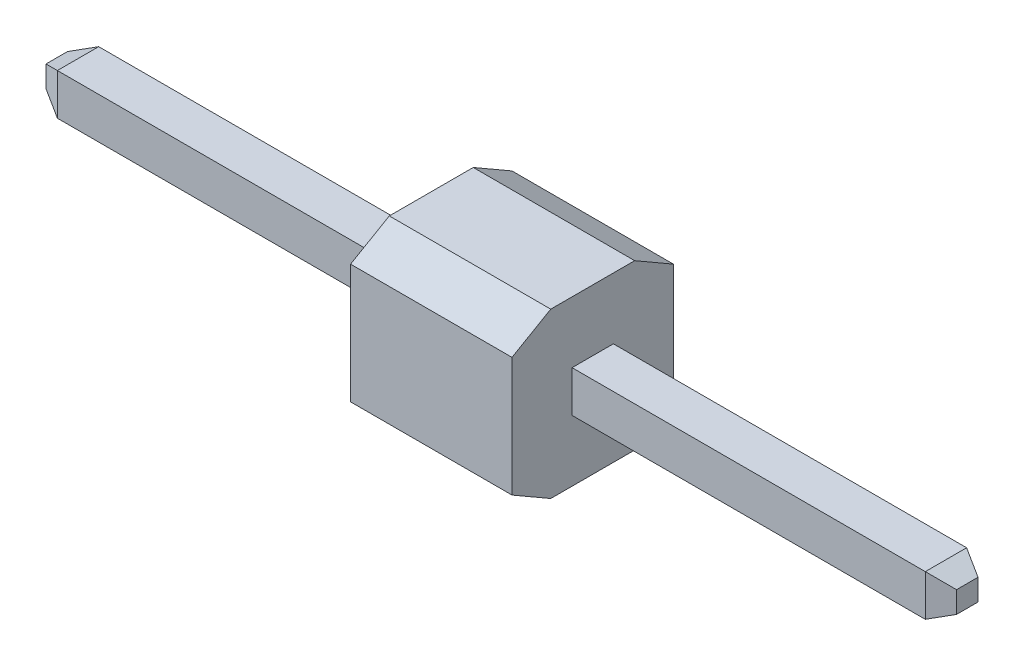
ISO-10303-21;
HEADER;
FILE_DESCRIPTION(('STEP AP214'),'2;1');
FILE_NAME('part.step','',(''),(''),'','','');
FILE_SCHEMA(('AUTOMOTIVE_DESIGN { 1 0 10303 214 1 1 1 1 }'));
ENDSEC;
DATA;
#1=APPLICATION_CONTEXT('core data for automotive mechanical design processes');
#2=APPLICATION_PROTOCOL_DEFINITION('international standard','automotive_design',2000,#1);
#3=PRODUCT_CONTEXT('',#1,'mechanical');
#4=PRODUCT('Part','Part','',(#3));
#5=PRODUCT_RELATED_PRODUCT_CATEGORY('part','',(#4));
#6=PRODUCT_DEFINITION_FORMATION('','',#4);
#7=PRODUCT_DEFINITION_CONTEXT('part definition',#1,'design');
#8=PRODUCT_DEFINITION('design','',#6,#7);
#9=PRODUCT_DEFINITION_SHAPE('','',#8);
#10=(LENGTH_UNIT() NAMED_UNIT(*) SI_UNIT(.MILLI.,.METRE.));
#11=(NAMED_UNIT(*) PLANE_ANGLE_UNIT() SI_UNIT($,.RADIAN.));
#12=(NAMED_UNIT(*) SI_UNIT($,.STERADIAN.) SOLID_ANGLE_UNIT());
#13=UNCERTAINTY_MEASURE_WITH_UNIT(LENGTH_MEASURE(1.E-05),#10,'distance_accuracy_value','');
#14=(GEOMETRIC_REPRESENTATION_CONTEXT(3) GLOBAL_UNCERTAINTY_ASSIGNED_CONTEXT((#13)) GLOBAL_UNIT_ASSIGNED_CONTEXT((#10,
#11,#12)) REPRESENTATION_CONTEXT('',''));
#15=CARTESIAN_POINT('',(0.,0.,0.));
#16=DIRECTION('',(0.,0.,1.));
#17=DIRECTION('',(1.,0.,0.));
#18=AXIS2_PLACEMENT_3D('',#15,#16,#17);
#19=CARTESIAN_POINT('',(5.42110019531582,-2.22288427394286,-2.77112037351091));
#20=DIRECTION('',(1.,-9.93476518829084E-08,4.37113882867379E-08));
#21=DIRECTION('',(-9.93476589883358E-08,-1.,8.74227765734759E-08));
#22=AXIS2_PLACEMENT_3D('',#19,#20,#21);
#23=PLANE('',#22);
#24=DIRECTION('',(-1.18186619959243E-08,-0.50000007571054,-0.866025360072933));
#25=VECTOR('',#24,1.);
#26=CARTESIAN_POINT('',(5.42110000314121,-3.46647397517509,-1.20112026479284));
#27=LINE('',#26,#25);
#28=CARTESIAN_POINT('',(5.42110000314121,-3.46647397517509,-1.20112026479284));
#29=VERTEX_POINT('',#28);
#30=CARTESIAN_POINT('',(5.421099994953,-3.81288418914276,-1.8011202345087));
#31=VERTEX_POINT('',#30);
#32=EDGE_CURVE('E11',#29,#31,#27,.T.);
#33=ORIENTED_EDGE('',*,*,#32,.T.);
#34=DIRECTION('',(4.37113811813104E-08,-8.74227828590458E-08,-0.999999999999995));
#35=VECTOR('',#34,1.);
#36=CARTESIAN_POINT('',(5.421099994953,-3.81288418914276,-1.8011202345087));
#37=LINE('',#36,#35);
#38=CARTESIAN_POINT('',(5.4211000517778,-3.81288430279238,-3.1011202345087));
#39=VERTEX_POINT('',#38);
#40=EDGE_CURVE('E304',#31,#39,#37,.T.);
#41=ORIENTED_EDGE('',*,*,#40,.T.);
#42=DIRECTION('',(8.75289950709518E-08,0.499999924289835,-0.866025447495714));
#43=VECTOR('',#42,1.);
#44=CARTESIAN_POINT('',(5.4211000517778,-3.81288430279238,-3.1011202345087));
#45=LINE('',#44,#43);
#46=CARTESIAN_POINT('',(5.42110011241966,-3.46647419373205,-3.70112026479284));
#47=VERTEX_POINT('',#46);
#48=EDGE_CURVE('E296',#39,#47,#45,.T.);
#49=ORIENTED_EDGE('',*,*,#48,.T.);
#50=DIRECTION('',(9.93476593246923E-08,0.999999999999991,-8.7422776482468E-08));
#51=VECTOR('',#50,1.);
#52=CARTESIAN_POINT('',(5.42110011241966,-3.46647419373205,-3.70112026479284));
#53=LINE('',#52,#51);
#54=CARTESIAN_POINT('',(5.42110029593264,-1.61929451676605,-3.70112042627841));
#55=VERTEX_POINT('',#54);
#56=EDGE_CURVE('E281',#47,#55,#53,.T.);
#57=ORIENTED_EDGE('',*,*,#56,.T.);
#58=DIRECTION('',(-1.18186619958731E-08,-0.500000075710537,-0.866025360072935));
#59=VECTOR('',#58,1.);
#60=CARTESIAN_POINT('',(5.42110030412085,-1.27288430279238,-3.10112045656255));
#61=LINE('',#60,#59);
#62=CARTESIAN_POINT('',(5.42110030412085,-1.27288430279238,-3.10112045656255));
#63=VERTEX_POINT('',#62);
#64=EDGE_CURVE('E265',#63,#55,#61,.T.);
#65=ORIENTED_EDGE('',*,*,#64,.F.);
#66=DIRECTION('',(4.37113811813104E-08,-8.74227828590458E-08,-0.999999999999995));
#67=VECTOR('',#66,1.);
#68=CARTESIAN_POINT('',(5.42110024729606,-1.27288418914276,-1.80112045656255));
#69=LINE('',#68,#67);
#70=CARTESIAN_POINT('',(5.42110024729606,-1.27288418914276,-1.80112045656255));
#71=VERTEX_POINT('',#70);
#72=EDGE_CURVE('E248',#71,#63,#69,.T.);
#73=ORIENTED_EDGE('',*,*,#72,.F.);
#74=DIRECTION('',(8.75289950705729E-08,0.499999924289834,-0.866025447495714));
#75=VECTOR('',#74,1.);
#76=CARTESIAN_POINT('',(5.42110018665419,-1.61929429820909,-1.20112042627841));
#77=LINE('',#76,#75);
#78=CARTESIAN_POINT('',(5.42110018665419,-1.61929429820909,-1.20112042627841));
#79=VERTEX_POINT('',#78);
#80=EDGE_CURVE('E242',#79,#71,#77,.T.);
#81=ORIENTED_EDGE('',*,*,#80,.F.);
#82=DIRECTION('',(9.93476593246923E-08,0.999999999999991,-8.7422776482468E-08));
#83=VECTOR('',#82,1.);
#84=CARTESIAN_POINT('',(5.42110000314121,-3.46647397517509,-1.20112026479284));
#85=LINE('',#84,#83);
#86=EDGE_CURVE('E236',#29,#79,#85,.T.);
#87=ORIENTED_EDGE('',*,*,#86,.F.);
#88=EDGE_LOOP('',(#33,#41,#49,#57,#65,#73,#81,#87));
#89=FACE_BOUND('',#88,.T.);
#90=DIRECTION('',(-4.37113803486431E-08,8.74227829017466E-08,0.999999999999995));
#91=VECTOR('',#90,1.);
#92=CARTESIAN_POINT('',(5.42110013173332,-2.86288427394286,-2.77112031756034));
#93=LINE('',#92,#91);
#94=CARTESIAN_POINT('',(5.42110013173332,-2.86288427394286,-2.77112031756034));
#95=VERTEX_POINT('',#94);
#96=CARTESIAN_POINT('',(5.42110010375803,-2.86288421799228,-2.13112031756034));
#97=VERTEX_POINT('',#96);
#98=EDGE_CURVE('E302',#95,#97,#93,.T.);
#99=ORIENTED_EDGE('',*,*,#98,.T.);
#100=DIRECTION('',(-9.93476592658906E-08,-0.999999999999991,8.74227766567418E-08));
#101=VECTOR('',#100,1.);
#102=CARTESIAN_POINT('',(5.42110016734054,-2.22288421799228,-2.13112037351091));
#103=LINE('',#102,#101);
#104=CARTESIAN_POINT('',(5.42110016734054,-2.22288421799228,-2.13112037351091));
#105=VERTEX_POINT('',#104);
#106=EDGE_CURVE('E293',#105,#97,#103,.T.);
#107=ORIENTED_EDGE('',*,*,#106,.F.);
#108=DIRECTION('',(-4.37113803486431E-08,8.74227829017466E-08,0.999999999999995));
#109=VECTOR('',#108,1.);
#110=CARTESIAN_POINT('',(5.42110019531582,-2.22288427394286,-2.77112037351091));
#111=LINE('',#110,#109);
#112=CARTESIAN_POINT('',(5.42110019531582,-2.22288427394286,-2.77112037351091));
#113=VERTEX_POINT('',#112);
#114=EDGE_CURVE('E278',#113,#105,#111,.T.);
#115=ORIENTED_EDGE('',*,*,#114,.F.);
#116=DIRECTION('',(-9.93476592658906E-08,-0.999999999999991,8.74227766567418E-08));
#117=VECTOR('',#116,1.);
#118=CARTESIAN_POINT('',(5.42110019531582,-2.22288427394286,-2.77112037351091));
#119=LINE('',#118,#117);
#120=EDGE_CURVE('E263',#113,#95,#119,.T.);
#121=ORIENTED_EDGE('',*,*,#120,.T.);
#122=EDGE_LOOP('',(#99,#107,#115,#121));
#123=FACE_BOUND('',#122,.T.);
#124=ADVANCED_FACE('F17',(#89,#123),#23,.T.);
#125=CARTESIAN_POINT('',(2.92110019531582,-2.22288402557373,-2.77112048278938));
#126=DIRECTION('',(1.,-9.93476518829084E-08,4.37113882867379E-08));
#127=DIRECTION('',(-9.93476589883358E-08,-1.,8.74227765734759E-08));
#128=AXIS2_PLACEMENT_3D('',#125,#126,#127);
#129=PLANE('',#128);
#130=DIRECTION('',(-1.18186632778994E-08,-0.50000007571054,-0.866025360072933));
#131=VECTOR('',#130,1.);
#132=CARTESIAN_POINT('',(2.92110000314121,-3.46647372680596,-1.20112037407131));
#133=LINE('',#132,#131);
#134=CARTESIAN_POINT('',(2.92110000314121,-3.46647372680596,-1.20112037407131));
#135=VERTEX_POINT('',#134);
#136=CARTESIAN_POINT('',(2.921099994953,-3.81288394077363,-1.80112034378717));
#137=VERTEX_POINT('',#136);
#138=EDGE_CURVE('E24',#135,#137,#133,.T.);
#139=ORIENTED_EDGE('',*,*,#138,.F.);
#140=DIRECTION('',(9.93476588438628E-08,0.999999999999991,-8.7422776482468E-08));
#141=VECTOR('',#140,1.);
#142=CARTESIAN_POINT('',(2.92110000314121,-3.46647372680596,-1.20112037407131));
#143=LINE('',#142,#141);
#144=CARTESIAN_POINT('',(2.92110018665419,-1.61929404983996,-1.20112053555688));
#145=VERTEX_POINT('',#144);
#146=EDGE_CURVE('E300',#135,#145,#143,.T.);
#147=ORIENTED_EDGE('',*,*,#146,.T.);
#148=DIRECTION('',(8.7528996352548E-08,0.499999924289834,-0.866025447495714));
#149=VECTOR('',#148,1.);
#150=CARTESIAN_POINT('',(2.92110018665419,-1.61929404983996,-1.20112053555688));
#151=LINE('',#150,#149);
#152=CARTESIAN_POINT('',(2.92110024729606,-1.27288394077363,-1.80112056584102));
#153=VERTEX_POINT('',#152);
#154=EDGE_CURVE('E286',#145,#153,#151,.T.);
#155=ORIENTED_EDGE('',*,*,#154,.T.);
#156=DIRECTION('',(4.37113811813104E-08,-8.74227828590458E-08,-0.999999999999995));
#157=VECTOR('',#156,1.);
#158=CARTESIAN_POINT('',(2.92110024729606,-1.27288394077363,-1.80112056584102));
#159=LINE('',#158,#157);
#160=CARTESIAN_POINT('',(2.92110030412085,-1.27288405442325,-3.10112056584102));
#161=VERTEX_POINT('',#160);
#162=EDGE_CURVE('E271',#153,#161,#159,.T.);
#163=ORIENTED_EDGE('',*,*,#162,.T.);
#164=DIRECTION('',(-1.18186632778483E-08,-0.500000075710537,-0.866025360072935));
#165=VECTOR('',#164,1.);
#166=CARTESIAN_POINT('',(2.92110030412085,-1.27288405442325,-3.10112056584102));
#167=LINE('',#166,#165);
#168=CARTESIAN_POINT('',(2.92110029593264,-1.61929426839692,-3.70112053555688));
#169=VERTEX_POINT('',#168);
#170=EDGE_CURVE('E253',#161,#169,#167,.T.);
#171=ORIENTED_EDGE('',*,*,#170,.T.);
#172=DIRECTION('',(9.93476588438628E-08,0.999999999999991,-8.7422776482468E-08));
#173=VECTOR('',#172,1.);
#174=CARTESIAN_POINT('',(2.92110011241966,-3.46647394536292,-3.70112037407131));
#175=LINE('',#174,#173);
#176=CARTESIAN_POINT('',(2.92110011241966,-3.46647394536292,-3.70112037407131));
#177=VERTEX_POINT('',#176);
#178=EDGE_CURVE('E261',#177,#169,#175,.T.);
#179=ORIENTED_EDGE('',*,*,#178,.F.);
#180=DIRECTION('',(8.75289963529269E-08,0.499999924289835,-0.866025447495714));
#181=VECTOR('',#180,1.);
#182=CARTESIAN_POINT('',(2.9211000517778,-3.81288405442325,-3.10112034378717));
#183=LINE('',#182,#181);
#184=CARTESIAN_POINT('',(2.9211000517778,-3.81288405442325,-3.10112034378717));
#185=VERTEX_POINT('',#184);
#186=EDGE_CURVE('E276',#185,#177,#183,.T.);
#187=ORIENTED_EDGE('',*,*,#186,.F.);
#188=DIRECTION('',(4.37113811813104E-08,-8.74227828590458E-08,-0.999999999999995));
#189=VECTOR('',#188,1.);
#190=CARTESIAN_POINT('',(2.921099994953,-3.81288394077363,-1.80112034378717));
#191=LINE('',#190,#189);
#192=EDGE_CURVE('E291',#137,#185,#191,.T.);
#193=ORIENTED_EDGE('',*,*,#192,.F.);
#194=EDGE_LOOP('',(#139,#147,#155,#163,#171,#179,#187,#193));
#195=FACE_BOUND('',#194,.T.);
#196=DIRECTION('',(-9.93476585720012E-08,-0.999999999999991,8.74227766567418E-08));
#197=VECTOR('',#196,1.);
#198=CARTESIAN_POINT('',(2.92110016734053,-2.22288396962315,-2.13112048278938));
#199=LINE('',#198,#197);
#200=CARTESIAN_POINT('',(2.92110016734053,-2.22288396962315,-2.13112048278938));
#201=VERTEX_POINT('',#200);
#202=CARTESIAN_POINT('',(2.92110010375803,-2.86288396962315,-2.13112042683881));
#203=VERTEX_POINT('',#202);
#204=EDGE_CURVE('E298',#201,#203,#199,.T.);
#205=ORIENTED_EDGE('',*,*,#204,.T.);
#206=DIRECTION('',(-4.37113810425325E-08,8.74227829017466E-08,0.999999999999995));
#207=VECTOR('',#206,1.);
#208=CARTESIAN_POINT('',(2.92110013173332,-2.86288402557373,-2.77112042683881));
#209=LINE('',#208,#207);
#210=CARTESIAN_POINT('',(2.92110013173332,-2.86288402557373,-2.77112042683881));
#211=VERTEX_POINT('',#210);
#212=EDGE_CURVE('E283',#211,#203,#209,.T.);
#213=ORIENTED_EDGE('',*,*,#212,.F.);
#214=DIRECTION('',(-9.93476585720012E-08,-0.999999999999991,8.74227766567418E-08));
#215=VECTOR('',#214,1.);
#216=CARTESIAN_POINT('',(2.92110019531582,-2.22288402557373,-2.77112048278938));
#217=LINE('',#216,#215);
#218=CARTESIAN_POINT('',(2.92110019531582,-2.22288402557373,-2.77112048278938));
#219=VERTEX_POINT('',#218);
#220=EDGE_CURVE('E268',#219,#211,#217,.T.);
#221=ORIENTED_EDGE('',*,*,#220,.F.);
#222=DIRECTION('',(-4.37113810425325E-08,8.74227829017466E-08,0.999999999999995));
#223=VECTOR('',#222,1.);
#224=CARTESIAN_POINT('',(2.92110019531582,-2.22288402557373,-2.77112048278938));
#225=LINE('',#224,#223);
#226=EDGE_CURVE('E251',#219,#201,#225,.T.);
#227=ORIENTED_EDGE('',*,*,#226,.T.);
#228=EDGE_LOOP('',(#205,#213,#221,#227));
#229=FACE_BOUND('',#228,.T.);
#230=ADVANCED_FACE('F314',(#195,#229),#129,.F.);
#231=CARTESIAN_POINT('',(5.42110000314121,-3.46647397517509,-1.20112026479284));
#232=DIRECTION('',(1.07893287081065E-07,0.866025360072937,-0.500000075710535));
#233=DIRECTION('',(1.18186629566715E-08,0.500000075710542,0.866025360072941));
#234=AXIS2_PLACEMENT_3D('',#231,#232,#233);
#235=PLANE('',#234);
#236=ORIENTED_EDGE('',*,*,#138,.T.);
#237=DIRECTION('',(-0.999999999999994,9.93476518829078E-08,-4.37113883755555E-08));
#238=VECTOR('',#237,1.);
#239=CARTESIAN_POINT('',(5.421099994953,-3.81288418914276,-1.8011202345087));
#240=LINE('',#239,#238);
#241=EDGE_CURVE('E288',#31,#137,#240,.T.);
#242=ORIENTED_EDGE('',*,*,#241,.F.);
#243=ORIENTED_EDGE('',*,*,#32,.F.);
#244=DIRECTION('',(-0.999999999999994,9.93476525934506E-08,-4.3711388109102E-08));
#245=VECTOR('',#244,1.);
#246=CARTESIAN_POINT('',(5.42110000314121,-3.46647397517509,-1.20112026479284));
#247=LINE('',#246,#245);
#248=EDGE_CURVE('E256',#29,#135,#247,.T.);
#249=ORIENTED_EDGE('',*,*,#248,.T.);
#250=EDGE_LOOP('',(#236,#242,#243,#249));
#251=FACE_BOUND('',#250,.T.);
#252=ADVANCED_FACE('F306',(#251),#235,.F.);
#253=CARTESIAN_POINT('',(5.421099994953,-3.81288418914276,-1.8011202345087));
#254=DIRECTION('',(9.93476589883358E-08,1.,-8.74227765734759E-08));
#255=DIRECTION('',(1.,-9.93476518829084E-08,4.37113882867379E-08));
#256=AXIS2_PLACEMENT_3D('',#253,#254,#255);
#257=PLANE('',#256);
#258=ORIENTED_EDGE('',*,*,#192,.T.);
#259=DIRECTION('',(-0.999999999999994,9.93476518829078E-08,-4.37113884643734E-08));
#260=VECTOR('',#259,1.);
#261=CARTESIAN_POINT('',(5.4211000517778,-3.81288430279238,-3.1011202345087));
#262=LINE('',#261,#260);
#263=EDGE_CURVE('E273',#39,#185,#262,.T.);
#264=ORIENTED_EDGE('',*,*,#263,.F.);
#265=ORIENTED_EDGE('',*,*,#40,.F.);
#266=ORIENTED_EDGE('',*,*,#241,.T.);
#267=EDGE_LOOP('',(#258,#264,#265,#266));
#268=FACE_BOUND('',#267,.T.);
#269=ADVANCED_FACE('F311',(#268),#257,.F.);
#270=CARTESIAN_POINT('',(5.4211000517778,-3.81288430279238,-3.1011202345087));
#271=DIRECTION('',(6.41819058997377E-08,0.866025447495721,0.499999924289845));
#272=DIRECTION('',(-8.7528996031702E-08,-0.499999924289838,0.866025447495717));
#273=AXIS2_PLACEMENT_3D('',#270,#271,#272);
#274=PLANE('',#273);
#275=ORIENTED_EDGE('',*,*,#186,.T.);
#276=DIRECTION('',(-0.999999999999994,9.93476525934506E-08,-4.37113882867377E-08));
#277=VECTOR('',#276,1.);
#278=CARTESIAN_POINT('',(5.42110011241966,-3.46647419373205,-3.70112026479284));
#279=LINE('',#278,#277);
#280=EDGE_CURVE('E258',#47,#177,#279,.T.);
#281=ORIENTED_EDGE('',*,*,#280,.F.);
#282=ORIENTED_EDGE('',*,*,#48,.F.);
#283=ORIENTED_EDGE('',*,*,#263,.T.);
#284=EDGE_LOOP('',(#275,#281,#282,#283));
#285=FACE_BOUND('',#284,.T.);
#286=ADVANCED_FACE('F319',(#285),#274,.F.);
#287=CARTESIAN_POINT('',(5.42110011241966,-3.46647419373205,-3.70112026479284));
#288=DIRECTION('',(-4.37113811813106E-08,8.74227836789032E-08,1.));
#289=DIRECTION('',(-1.,9.93476518829084E-08,-4.37113882867379E-08));
#290=AXIS2_PLACEMENT_3D('',#287,#288,#289);
#291=PLANE('',#290);
#292=ORIENTED_EDGE('',*,*,#178,.T.);
#293=DIRECTION('',(-0.999999999999994,9.93476525934505E-08,-4.37113884643734E-08));
#294=VECTOR('',#293,1.);
#295=CARTESIAN_POINT('',(5.42110029593264,-1.61929451676605,-3.70112042627841));
#296=LINE('',#295,#294);
#297=EDGE_CURVE('E245',#55,#169,#296,.T.);
#298=ORIENTED_EDGE('',*,*,#297,.F.);
#299=ORIENTED_EDGE('',*,*,#56,.F.);
#300=ORIENTED_EDGE('',*,*,#280,.T.);
#301=EDGE_LOOP('',(#292,#298,#299,#300));
#302=FACE_BOUND('',#301,.T.);
#303=ADVANCED_FACE('F326',(#302),#291,.F.);
#304=CARTESIAN_POINT('',(5.42110030412085,-1.27288430279238,-3.10112045656255));
#305=DIRECTION('',(1.07893287081065E-07,0.866025360072937,-0.500000075710535));
#306=DIRECTION('',(1.18186629566715E-08,0.500000075710542,0.866025360072941));
#307=AXIS2_PLACEMENT_3D('',#304,#305,#306);
#308=PLANE('',#307);
#309=ORIENTED_EDGE('',*,*,#170,.F.);
#310=DIRECTION('',(-0.999999999999994,9.93476518829078E-08,-4.37113882867377E-08));
#311=VECTOR('',#310,1.);
#312=CARTESIAN_POINT('',(5.42110030412085,-1.27288430279238,-3.10112045656255));
#313=LINE('',#312,#311);
#314=EDGE_CURVE('E239',#63,#161,#313,.T.);
#315=ORIENTED_EDGE('',*,*,#314,.F.);
#316=ORIENTED_EDGE('',*,*,#64,.T.);
#317=ORIENTED_EDGE('',*,*,#297,.T.);
#318=EDGE_LOOP('',(#309,#315,#316,#317));
#319=FACE_BOUND('',#318,.T.);
#320=ADVANCED_FACE('F329',(#319),#308,.T.);
#321=CARTESIAN_POINT('',(5.42110024729606,-1.27288418914276,-1.80112045656255));
#322=DIRECTION('',(9.93476589883358E-08,1.,-8.74227765734759E-08));
#323=DIRECTION('',(1.,-9.93476518829084E-08,4.37113882867379E-08));
#324=AXIS2_PLACEMENT_3D('',#321,#322,#323);
#325=PLANE('',#324);
#326=ORIENTED_EDGE('',*,*,#162,.F.);
#327=DIRECTION('',(-0.999999999999994,9.93476518829078E-08,-4.37113883755555E-08));
#328=VECTOR('',#327,1.);
#329=CARTESIAN_POINT('',(5.42110024729606,-1.27288418914276,-1.80112045656255));
#330=LINE('',#329,#328);
#331=EDGE_CURVE('E233',#71,#153,#330,.T.);
#332=ORIENTED_EDGE('',*,*,#331,.F.);
#333=ORIENTED_EDGE('',*,*,#72,.T.);
#334=ORIENTED_EDGE('',*,*,#314,.T.);
#335=EDGE_LOOP('',(#326,#332,#333,#334));
#336=FACE_BOUND('',#335,.T.);
#337=ADVANCED_FACE('F333',(#336),#325,.T.);
#338=CARTESIAN_POINT('',(5.42110018665419,-1.61929429820909,-1.20112042627841));
#339=DIRECTION('',(6.41819058997377E-08,0.866025447495721,0.499999924289845));
#340=DIRECTION('',(-8.7528996031702E-08,-0.499999924289838,0.866025447495717));
#341=AXIS2_PLACEMENT_3D('',#338,#339,#340);
#342=PLANE('',#341);
#343=ORIENTED_EDGE('',*,*,#154,.F.);
#344=DIRECTION('',(-0.999999999999994,9.93476525934505E-08,-4.3711388109102E-08));
#345=VECTOR('',#344,1.);
#346=CARTESIAN_POINT('',(5.42110018665419,-1.61929429820909,-1.20112042627841));
#347=LINE('',#346,#345);
#348=EDGE_CURVE('E230',#79,#145,#347,.T.);
#349=ORIENTED_EDGE('',*,*,#348,.F.);
#350=ORIENTED_EDGE('',*,*,#80,.T.);
#351=ORIENTED_EDGE('',*,*,#331,.T.);
#352=EDGE_LOOP('',(#343,#349,#350,#351));
#353=FACE_BOUND('',#352,.T.);
#354=ADVANCED_FACE('F337',(#353),#342,.T.);
#355=CARTESIAN_POINT('',(5.42110000314121,-3.46647397517509,-1.20112026479284));
#356=DIRECTION('',(-4.37113811813106E-08,8.74227835615132E-08,1.));
#357=DIRECTION('',(-9.93476589883358E-08,-1.,8.74227764560859E-08));
#358=AXIS2_PLACEMENT_3D('',#355,#356,#357);
#359=PLANE('',#358);
#360=ORIENTED_EDGE('',*,*,#146,.F.);
#361=ORIENTED_EDGE('',*,*,#248,.F.);
#362=ORIENTED_EDGE('',*,*,#86,.T.);
#363=ORIENTED_EDGE('',*,*,#348,.T.);
#364=EDGE_LOOP('',(#360,#361,#362,#363));
#365=FACE_BOUND('',#364,.T.);
#366=ADVANCED_FACE('F339',(#365),#359,.T.);
#367=CARTESIAN_POINT('',(-2.87889980468418,-2.22288344935735,-2.77112073631544));
#368=DIRECTION('',(-1.,9.93476518829084E-08,-4.37113882867379E-08));
#369=DIRECTION('',(9.93476589883358E-08,1.,-8.74227765734759E-08));
#370=AXIS2_PLACEMENT_3D('',#367,#368,#369);
#371=PLANE('',#370);
#372=DIRECTION('',(9.93476554747621E-08,0.999999999999991,-8.74227761417747E-08));
#373=VECTOR('',#372,1.);
#374=CARTESIAN_POINT('',(-2.87889987422782,-2.70900187966852,-2.28500222100861));
#375=LINE('',#374,#373);
#376=CARTESIAN_POINT('',(-2.87889987422782,-2.70900187966852,-2.28500222100861));
#377=VERTEX_POINT('',#376);
#378=CARTESIAN_POINT('',(-2.87889984122086,-2.37676493405952,-2.28500225005369));
#379=VERTEX_POINT('',#378);
#380=EDGE_CURVE('E228',#377,#379,#375,.T.);
#381=ORIENTED_EDGE('',*,*,#380,.T.);
#382=DIRECTION('',(4.37113820547149E-08,-8.74227801493994E-08,-0.999999999999995));
#383=VECTOR('',#382,1.);
#384=CARTESIAN_POINT('',(-2.87889984122086,-2.37676493405952,-2.28500225005369));
#385=LINE('',#384,#383);
#386=CARTESIAN_POINT('',(-2.87889982669832,-2.3767649631046,-2.61723919567169));
#387=VERTEX_POINT('',#386);
#388=EDGE_CURVE('E223',#379,#387,#385,.T.);
#389=ORIENTED_EDGE('',*,*,#388,.T.);
#390=DIRECTION('',(-9.93476608214187E-08,-0.999999999999991,8.74227774784388E-08));
#391=VECTOR('',#390,1.);
#392=CARTESIAN_POINT('',(-2.87889982669832,-2.3767649631046,-2.61723919567169));
#393=LINE('',#392,#391);
#394=CARTESIAN_POINT('',(-2.87889985970529,-2.7090019087136,-2.61723916662661));
#395=VERTEX_POINT('',#394);
#396=EDGE_CURVE('E215',#387,#395,#393,.T.);
#397=ORIENTED_EDGE('',*,*,#396,.T.);
#398=DIRECTION('',(-4.37113767080584E-08,8.74227801493995E-08,0.999999999999995));
#399=VECTOR('',#398,1.);
#400=CARTESIAN_POINT('',(-2.87889985970529,-2.7090019087136,-2.61723916662661));
#401=LINE('',#400,#399);
#402=EDGE_CURVE('E207',#395,#377,#401,.T.);
#403=ORIENTED_EDGE('',*,*,#402,.T.);
#404=EDGE_LOOP('',(#381,#389,#397,#403));
#405=FACE_BOUND('',#404,.T.);
#406=ADVANCED_FACE('F341',(#405),#371,.T.);
#407=CARTESIAN_POINT('',(-2.87889980468418,-2.22288344935735,-2.77112073631544));
#408=DIRECTION('',(9.93476589883358E-08,1.,-8.74227764510112E-08));
#409=DIRECTION('',(-4.37113811813106E-08,8.74227835564385E-08,1.));
#410=AXIS2_PLACEMENT_3D('',#407,#408,#409);
#411=PLANE('',#410);
#412=DIRECTION('',(0.999999999999994,-9.93476524284799E-08,4.37113882769953E-08));
#413=VECTOR('',#412,1.);
#414=CARTESIAN_POINT('',(-2.54889980468418,-2.22288348214208,-2.77112072189068));
#415=LINE('',#414,#413);
#416=CARTESIAN_POINT('',(-2.54889980468418,-2.22288348214208,-2.77112072189068));
#417=VERTEX_POINT('',#416);
#418=EDGE_CURVE('E225',#417,#219,#415,.T.);
#419=ORIENTED_EDGE('',*,*,#418,.F.);
#420=DIRECTION('',(-4.37113803486431E-08,8.74227829017466E-08,0.999999999999995));
#421=VECTOR('',#420,1.);
#422=CARTESIAN_POINT('',(-2.54889980468418,-2.22288348214208,-2.77112072189068));
#423=LINE('',#422,#421);
#424=CARTESIAN_POINT('',(-2.54889983265946,-2.22288342619149,-2.13112072189068));
#425=VERTEX_POINT('',#424);
#426=EDGE_CURVE('E217',#417,#425,#423,.T.);
#427=ORIENTED_EDGE('',*,*,#426,.T.);
#428=DIRECTION('',(0.999999999999994,-9.934765242848E-08,4.3711388195809E-08));
#429=VECTOR('',#428,1.);
#430=CARTESIAN_POINT('',(-2.54889983265946,-2.22288342619149,-2.13112072189068));
#431=LINE('',#430,#429);
#432=EDGE_CURVE('E220',#425,#201,#431,.T.);
#433=ORIENTED_EDGE('',*,*,#432,.T.);
#434=ORIENTED_EDGE('',*,*,#226,.F.);
#435=EDGE_LOOP('',(#419,#427,#433,#434));
#436=FACE_BOUND('',#435,.T.);
#437=ADVANCED_FACE('F348',(#436),#411,.T.);
#438=CARTESIAN_POINT('',(-2.87889983265946,-2.22288339340677,-2.13112073631544));
#439=DIRECTION('',(-4.37113811813106E-08,8.74227836789032E-08,1.));
#440=DIRECTION('',(-1.,9.93476518829084E-08,-4.37113882867379E-08));
#441=AXIS2_PLACEMENT_3D('',#438,#439,#440);
#442=PLANE('',#441);
#443=ORIENTED_EDGE('',*,*,#432,.F.);
#444=DIRECTION('',(-9.93476592658906E-08,-0.999999999999991,8.74227766567418E-08));
#445=VECTOR('',#444,1.);
#446=CARTESIAN_POINT('',(-2.54889983265946,-2.22288342619149,-2.13112072189068));
#447=LINE('',#446,#445);
#448=CARTESIAN_POINT('',(-2.54889989624197,-2.86288342619149,-2.1311206659401));
#449=VERTEX_POINT('',#448);
#450=EDGE_CURVE('E209',#425,#449,#447,.T.);
#451=ORIENTED_EDGE('',*,*,#450,.T.);
#452=DIRECTION('',(0.999999999999994,-9.93476524284799E-08,4.3711388195809E-08));
#453=VECTOR('',#452,1.);
#454=CARTESIAN_POINT('',(-2.54889989624197,-2.86288342619149,-2.1311206659401));
#455=LINE('',#454,#453);
#456=EDGE_CURVE('E212',#449,#203,#455,.T.);
#457=ORIENTED_EDGE('',*,*,#456,.T.);
#458=ORIENTED_EDGE('',*,*,#204,.F.);
#459=EDGE_LOOP('',(#443,#451,#457,#458));
#460=FACE_BOUND('',#459,.T.);
#461=ADVANCED_FACE('F424',(#460),#442,.T.);
#462=CARTESIAN_POINT('',(-2.87889986826668,-2.86288344935735,-2.77112068036486));
#463=DIRECTION('',(9.93476589883357E-08,1.,-8.74227764040693E-08));
#464=DIRECTION('',(-4.37113811813106E-08,8.74227835094966E-08,1.));
#465=AXIS2_PLACEMENT_3D('',#462,#463,#464);
#466=PLANE('',#465);
#467=ORIENTED_EDGE('',*,*,#456,.F.);
#468=DIRECTION('',(4.37113817364219E-08,-8.74227829017466E-08,-0.999999999999995));
#469=VECTOR('',#468,1.);
#470=CARTESIAN_POINT('',(-2.54889989624197,-2.86288342619149,-2.1311206659401));
#471=LINE('',#470,#469);
#472=CARTESIAN_POINT('',(-2.54889986826668,-2.86288348214208,-2.7711206659401));
#473=VERTEX_POINT('',#472);
#474=EDGE_CURVE('E201',#449,#473,#471,.T.);
#475=ORIENTED_EDGE('',*,*,#474,.T.);
#476=DIRECTION('',(0.999999999999994,-9.93476524284799E-08,4.37113882769953E-08));
#477=VECTOR('',#476,1.);
#478=CARTESIAN_POINT('',(-2.54889986826668,-2.86288348214208,-2.7711206659401));
#479=LINE('',#478,#477);
#480=EDGE_CURVE('E204',#473,#211,#479,.T.);
#481=ORIENTED_EDGE('',*,*,#480,.T.);
#482=ORIENTED_EDGE('',*,*,#212,.T.);
#483=EDGE_LOOP('',(#467,#475,#481,#482));
#484=FACE_BOUND('',#483,.T.);
#485=ADVANCED_FACE('F421',(#484),#466,.F.);
#486=CARTESIAN_POINT('',(-2.87889980468418,-2.22288344935735,-2.77112073631544));
#487=DIRECTION('',(-4.37113811813106E-08,8.74227836789032E-08,1.));
#488=DIRECTION('',(-1.,9.93476518829084E-08,-4.37113882867379E-08));
#489=AXIS2_PLACEMENT_3D('',#486,#487,#488);
#490=PLANE('',#489);
#491=ORIENTED_EDGE('',*,*,#480,.F.);
#492=DIRECTION('',(9.93476578781118E-08,0.999999999999991,-8.74227766567418E-08));
#493=VECTOR('',#492,1.);
#494=CARTESIAN_POINT('',(-2.54889986826668,-2.86288348214208,-2.7711206659401));
#495=LINE('',#494,#493);
#496=EDGE_CURVE('E196',#473,#417,#495,.T.);
#497=ORIENTED_EDGE('',*,*,#496,.T.);
#498=ORIENTED_EDGE('',*,*,#418,.T.);
#499=ORIENTED_EDGE('',*,*,#220,.T.);
#500=EDGE_LOOP('',(#491,#497,#498,#499));
#501=FACE_BOUND('',#500,.T.);
#502=ADVANCED_FACE('F376',(#501),#490,.F.);
#503=CARTESIAN_POINT('',(-2.87889980468418,-2.22288344935735,-2.77112073631544));
#504=DIRECTION('',(-4.37113811813106E-08,8.74227836789032E-08,1.));
#505=DIRECTION('',(-1.,9.93476518829084E-08,-4.37113882867379E-08));
#506=AXIS2_PLACEMENT_3D('',#503,#504,#505);
#507=PLANE('',#506);
#508=DIRECTION('',(0.999999999999994,-9.93476517789893E-08,4.37113882769953E-08));
#509=VECTOR('',#508,1.);
#510=CARTESIAN_POINT('',(5.42110019531582,-2.22288427394286,-2.77112037351091));
#511=LINE('',#510,#509);
#512=CARTESIAN_POINT('',(10.8911001953158,-2.22288481737452,-2.77112013440962));
#513=VERTEX_POINT('',#512);
#514=EDGE_CURVE('E199',#113,#513,#511,.T.);
#515=ORIENTED_EDGE('',*,*,#514,.T.);
#516=DIRECTION('',(-9.93476606536693E-08,-0.999999999999991,8.74227766567418E-08));
#517=VECTOR('',#516,1.);
#518=CARTESIAN_POINT('',(10.8911001953158,-2.22288481737452,-2.77112013440962));
#519=LINE('',#518,#517);
#520=CARTESIAN_POINT('',(10.8911001317333,-2.86288481737452,-2.77112007845904));
#521=VERTEX_POINT('',#520);
#522=EDGE_CURVE('E191',#513,#521,#519,.T.);
#523=ORIENTED_EDGE('',*,*,#522,.T.);
#524=DIRECTION('',(0.999999999999994,-9.93476517789893E-08,4.37113882769953E-08));
#525=VECTOR('',#524,1.);
#526=CARTESIAN_POINT('',(5.42110013173332,-2.86288427394286,-2.77112031756034));
#527=LINE('',#526,#525);
#528=EDGE_CURVE('E194',#95,#521,#527,.T.);
#529=ORIENTED_EDGE('',*,*,#528,.F.);
#530=ORIENTED_EDGE('',*,*,#120,.F.);
#531=EDGE_LOOP('',(#515,#523,#529,#530));
#532=FACE_BOUND('',#531,.T.);
#533=ADVANCED_FACE('F367',(#532),#507,.F.);
#534=CARTESIAN_POINT('',(-2.87889986826668,-2.86288344935735,-2.77112068036486));
#535=DIRECTION('',(9.93476589883357E-08,1.,-8.74227764040693E-08));
#536=DIRECTION('',(-4.37113811813106E-08,8.74227835094966E-08,1.));
#537=AXIS2_PLACEMENT_3D('',#534,#535,#536);
#538=PLANE('',#537);
#539=ORIENTED_EDGE('',*,*,#528,.T.);
#540=DIRECTION('',(-4.37113845119794E-08,8.74227829017466E-08,0.999999999999995));
#541=VECTOR('',#540,1.);
#542=CARTESIAN_POINT('',(10.8911001317333,-2.86288481737452,-2.77112007845904));
#543=LINE('',#542,#541);
#544=CARTESIAN_POINT('',(10.891100103758,-2.86288476142393,-2.13112007845904));
#545=VERTEX_POINT('',#544);
#546=EDGE_CURVE('E186',#521,#545,#543,.T.);
#547=ORIENTED_EDGE('',*,*,#546,.T.);
#548=DIRECTION('',(0.999999999999994,-9.93476517789893E-08,4.37113881146227E-08));
#549=VECTOR('',#548,1.);
#550=CARTESIAN_POINT('',(5.42110010375803,-2.86288421799228,-2.13112031756034));
#551=LINE('',#550,#549);
#552=EDGE_CURVE('E189',#97,#545,#551,.T.);
#553=ORIENTED_EDGE('',*,*,#552,.F.);
#554=ORIENTED_EDGE('',*,*,#98,.F.);
#555=EDGE_LOOP('',(#539,#547,#553,#554));
#556=FACE_BOUND('',#555,.T.);
#557=ADVANCED_FACE('F364',(#556),#538,.F.);
#558=CARTESIAN_POINT('',(-2.87889983265946,-2.22288339340677,-2.13112073631544));
#559=DIRECTION('',(-4.37113811813106E-08,8.74227836789032E-08,1.));
#560=DIRECTION('',(-1.,9.93476518829084E-08,-4.37113882867379E-08));
#561=AXIS2_PLACEMENT_3D('',#558,#559,#560);
#562=PLANE('',#561);
#563=ORIENTED_EDGE('',*,*,#552,.T.);
#564=DIRECTION('',(9.93476606536693E-08,0.999999999999991,-8.74227766567418E-08));
#565=VECTOR('',#564,1.);
#566=CARTESIAN_POINT('',(10.891100103758,-2.86288476142393,-2.13112007845904));
#567=LINE('',#566,#565);
#568=CARTESIAN_POINT('',(10.8911001673405,-2.22288476142393,-2.13112013440962));
#569=VERTEX_POINT('',#568);
#570=EDGE_CURVE('E176',#545,#569,#567,.T.);
#571=ORIENTED_EDGE('',*,*,#570,.T.);
#572=DIRECTION('',(0.999999999999994,-9.93476517789893E-08,4.37113881146227E-08));
#573=VECTOR('',#572,1.);
#574=CARTESIAN_POINT('',(5.42110016734054,-2.22288421799228,-2.13112037351091));
#575=LINE('',#574,#573);
#576=EDGE_CURVE('E179',#105,#569,#575,.T.);
#577=ORIENTED_EDGE('',*,*,#576,.F.);
#578=ORIENTED_EDGE('',*,*,#106,.T.);
#579=EDGE_LOOP('',(#563,#571,#577,#578));
#580=FACE_BOUND('',#579,.T.);
#581=ADVANCED_FACE('F366',(#580),#562,.T.);
#582=CARTESIAN_POINT('',(-2.87889980468418,-2.22288344935735,-2.77112073631544));
#583=DIRECTION('',(9.93476589883358E-08,1.,-8.74227764510112E-08));
#584=DIRECTION('',(-4.37113811813106E-08,8.74227835564385E-08,1.));
#585=AXIS2_PLACEMENT_3D('',#582,#583,#584);
#586=PLANE('',#585);
#587=ORIENTED_EDGE('',*,*,#576,.T.);
#588=DIRECTION('',(4.37113789608643E-08,-8.74227829017466E-08,-0.999999999999995));
#589=VECTOR('',#588,1.);
#590=CARTESIAN_POINT('',(10.8911001673405,-2.22288476142393,-2.13112013440962));
#591=LINE('',#590,#589);
#592=EDGE_CURVE('E167',#569,#513,#591,.T.);
#593=ORIENTED_EDGE('',*,*,#592,.T.);
#594=ORIENTED_EDGE('',*,*,#514,.F.);
#595=ORIENTED_EDGE('',*,*,#114,.T.);
#596=EDGE_LOOP('',(#587,#593,#594,#595));
#597=FACE_BOUND('',#596,.T.);
#598=ADVANCED_FACE('F373',(#597),#586,.T.);
#599=CARTESIAN_POINT('',(11.2211001953158,-2.22288485015924,-2.77112011998486));
#600=DIRECTION('',(-1.,9.93476518829084E-08,-4.37113882867379E-08));
#601=DIRECTION('',(9.93476589883358E-08,1.,-8.74227765734759E-08));
#602=AXIS2_PLACEMENT_3D('',#599,#600,#601);
#603=PLANE('',#602);
#604=DIRECTION('',(-9.93476581480904E-08,-0.999999999999991,8.74227774784388E-08));
#605=VECTOR('',#604,1.);
#606=CARTESIAN_POINT('',(11.2211001587791,-2.37676633486141,-2.28500163372311));
#607=LINE('',#606,#605);
#608=CARTESIAN_POINT('',(11.2211001587791,-2.37676633486141,-2.28500163372311));
#609=VERTEX_POINT('',#608);
#610=CARTESIAN_POINT('',(11.2211001257722,-2.70900328047041,-2.28500160467804));
#611=VERTEX_POINT('',#610);
#612=EDGE_CURVE('E153',#609,#611,#607,.T.);
#613=ORIENTED_EDGE('',*,*,#612,.T.);
#614=DIRECTION('',(4.37113767080583E-08,-8.74227801493994E-08,-0.999999999999995));
#615=VECTOR('',#614,1.);
#616=CARTESIAN_POINT('',(11.2211001257722,-2.70900328047041,-2.28500160467804));
#617=LINE('',#616,#615);
#618=CARTESIAN_POINT('',(11.2211001402947,-2.70900330951549,-2.61723855029604));
#619=VERTEX_POINT('',#618);
#620=EDGE_CURVE('E395',#611,#619,#617,.T.);
#621=ORIENTED_EDGE('',*,*,#620,.T.);
#622=DIRECTION('',(9.93476581480904E-08,0.999999999999991,-8.74227761417747E-08));
#623=VECTOR('',#622,1.);
#624=CARTESIAN_POINT('',(11.2211001402947,-2.70900330951549,-2.61723855029604));
#625=LINE('',#624,#623);
#626=CARTESIAN_POINT('',(11.2211001733017,-2.37676636390649,-2.61723857934111));
#627=VERTEX_POINT('',#626);
#628=EDGE_CURVE('E156',#619,#627,#625,.T.);
#629=ORIENTED_EDGE('',*,*,#628,.T.);
#630=DIRECTION('',(-4.37113820547149E-08,8.7422774802743E-08,0.999999999999995));
#631=VECTOR('',#630,1.);
#632=CARTESIAN_POINT('',(11.2211001733017,-2.37676636390649,-2.61723857934111));
#633=LINE('',#632,#631);
#634=EDGE_CURVE('E149',#627,#609,#633,.T.);
#635=ORIENTED_EDGE('',*,*,#634,.T.);
#636=EDGE_LOOP('',(#613,#621,#629,#635));
#637=FACE_BOUND('',#636,.T.);
#638=ADVANCED_FACE('F151',(#637),#603,.F.);
#639=CARTESIAN_POINT('',(-2.87889985297891,-2.70900192216635,-2.77112069381761));
#640=DIRECTION('',(-0.422618351780369,-0.906307745050466,6.07587120833484E-08));
#641=DIRECTION('',(4.37113811813106E-08,-8.74227835094966E-08,-1.));
#642=AXIS2_PLACEMENT_3D('',#639,#640,#641);
#643=PLANE('',#642);
#644=DIRECTION('',(0.83481707378875,-0.389281669540042,0.389281691158096));
#645=VECTOR('',#644,1.);
#646=CARTESIAN_POINT('',(-2.87889987422752,-2.70900187966819,-2.28500222100894));
#647=LINE('',#646,#645);
#648=EDGE_CURVE('E181',#377,#449,#647,.T.);
#649=ORIENTED_EDGE('',*,*,#648,.F.);
#650=ORIENTED_EDGE('',*,*,#402,.F.);
#651=DIRECTION('',(-0.83481710782082,0.38928173760421,0.389281550111905));
#652=VECTOR('',#651,1.);
#653=CARTESIAN_POINT('',(-2.54889986826646,-2.86288348214184,-2.77112066593987));
#654=LINE('',#653,#652);
#655=EDGE_CURVE('E404',#473,#395,#654,.T.);
#656=ORIENTED_EDGE('',*,*,#655,.F.);
#657=ORIENTED_EDGE('',*,*,#474,.F.);
#658=EDGE_LOOP('',(#649,#650,#656,#657));
#659=FACE_BOUND('',#658,.T.);
#660=ADVANCED_FACE('F418',(#659),#643,.T.);
#661=CARTESIAN_POINT('',(-2.87889981141056,-2.2228834359046,-2.61723920912444));
#662=DIRECTION('',(-0.422618222124847,-3.72458176658199E-08,-0.906307805509828));
#663=DIRECTION('',(9.93476589883358E-08,1.,-8.74227765734759E-08));
#664=AXIS2_PLACEMENT_3D('',#661,#662,#663);
#665=PLANE('',#664);
#666=ORIENTED_EDGE('',*,*,#655,.T.);
#667=ORIENTED_EDGE('',*,*,#396,.F.);
#668=DIRECTION('',(-0.834817185169259,-0.389281503665791,0.389281618176066));
#669=VECTOR('',#668,1.);
#670=CARTESIAN_POINT('',(-2.54889980468303,-2.22288348214481,-2.77112072189095));
#671=LINE('',#670,#669);
#672=EDGE_CURVE('E160',#417,#387,#671,.T.);
#673=ORIENTED_EDGE('',*,*,#672,.F.);
#674=ORIENTED_EDGE('',*,*,#496,.F.);
#675=EDGE_LOOP('',(#666,#667,#673,#674));
#676=FACE_BOUND('',#675,.T.);
#677=ADVANCED_FACE('F434',(#676),#665,.T.);
#678=CARTESIAN_POINT('',(-2.54889983265946,-2.22288342619149,-2.13112072189068));
#679=DIRECTION('',(0.422618301356777,-1.21218081559392E-07,-0.906307768563367));
#680=DIRECTION('',(-9.93476589883358E-08,-1.,8.74227765734759E-08));
#681=AXIS2_PLACEMENT_3D('',#678,#679,#680);
#682=PLANE('',#681);
#683=ORIENTED_EDGE('',*,*,#648,.T.);
#684=ORIENTED_EDGE('',*,*,#450,.F.);
#685=DIRECTION('',(0.834817151137183,0.389281571729962,0.389281623093935));
#686=VECTOR('',#685,1.);
#687=CARTESIAN_POINT('',(-2.8788998412237,-2.37676493405198,-2.28500225005515));
#688=LINE('',#687,#686);
#689=EDGE_CURVE('E170',#379,#425,#688,.T.);
#690=ORIENTED_EDGE('',*,*,#689,.F.);
#691=ORIENTED_EDGE('',*,*,#380,.F.);
#692=EDGE_LOOP('',(#683,#684,#690,#691));
#693=FACE_BOUND('',#692,.T.);
#694=ADVANCED_FACE('F413',(#693),#682,.F.);
#695=CARTESIAN_POINT('',(-2.54889980468418,-2.22288348214208,-2.77112072189068));
#696=DIRECTION('',(0.422618171701255,-0.906307829022729,9.770517399793E-08));
#697=DIRECTION('',(-4.37113811813106E-08,8.74227835564385E-08,1.));
#698=AXIS2_PLACEMENT_3D('',#695,#696,#697);
#699=PLANE('',#698);
#700=ORIENTED_EDGE('',*,*,#672,.T.);
#701=ORIENTED_EDGE('',*,*,#388,.F.);
#702=ORIENTED_EDGE('',*,*,#689,.T.);
#703=ORIENTED_EDGE('',*,*,#426,.F.);
#704=EDGE_LOOP('',(#700,#701,#702,#703));
#705=FACE_BOUND('',#704,.T.);
#706=ADVANCED_FACE('F429',(#705),#699,.F.);
#707=CARTESIAN_POINT('',(11.221100180028,-2.37676637735924,-2.77112010653211));
#708=DIRECTION('',(0.422618351780369,0.906307745050466,-6.07587121258922E-08));
#709=DIRECTION('',(4.37113811813106E-08,-8.74227835564385E-08,-1.));
#710=AXIS2_PLACEMENT_3D('',#707,#708,#709);
#711=PLANE('',#710);
#712=DIRECTION('',(-0.83481710782082,0.38928173760421,0.389281550111905));
#713=VECTOR('',#712,1.);
#714=CARTESIAN_POINT('',(11.2211001587818,-2.37676633485411,-2.28500163372481));
#715=LINE('',#714,#713);
#716=EDGE_CURVE('E164',#609,#569,#715,.T.);
#717=ORIENTED_EDGE('',*,*,#716,.F.);
#718=ORIENTED_EDGE('',*,*,#634,.F.);
#719=DIRECTION('',(0.834817073788748,-0.389281669540044,0.389281691158098));
#720=VECTOR('',#719,1.);
#721=CARTESIAN_POINT('',(10.8911001953158,-2.22288481737452,-2.77112013440962));
#722=LINE('',#721,#720);
#723=EDGE_CURVE('E392',#513,#627,#722,.T.);
#724=ORIENTED_EDGE('',*,*,#723,.F.);
#725=ORIENTED_EDGE('',*,*,#592,.F.);
#726=EDGE_LOOP('',(#717,#718,#724,#725));
#727=FACE_BOUND('',#726,.T.);
#728=ADVANCED_FACE('F165',(#727),#711,.T.);
#729=CARTESIAN_POINT('',(10.8911001953158,-2.22288481737452,-2.77112013440962));
#730=DIRECTION('',(-0.422618301356777,1.21218081559392E-07,0.906307768563367));
#731=DIRECTION('',(-9.93476589883358E-08,-1.,8.74227765734759E-08));
#732=AXIS2_PLACEMENT_3D('',#729,#730,#731);
#733=PLANE('',#732);
#734=ORIENTED_EDGE('',*,*,#723,.T.);
#735=ORIENTED_EDGE('',*,*,#628,.F.);
#736=DIRECTION('',(0.834817151137181,0.389281571729963,0.389281623093939));
#737=VECTOR('',#736,1.);
#738=CARTESIAN_POINT('',(10.8911001317332,-2.86288481737448,-2.7711200784589));
#739=LINE('',#738,#737);
#740=EDGE_CURVE('E389',#521,#619,#739,.T.);
#741=ORIENTED_EDGE('',*,*,#740,.F.);
#742=ORIENTED_EDGE('',*,*,#522,.F.);
#743=EDGE_LOOP('',(#734,#735,#741,#742));
#744=FACE_BOUND('',#743,.T.);
#745=ADVANCED_FACE('F390',(#744),#733,.F.);
#746=CARTESIAN_POINT('',(11.2211001740669,-2.22288480766141,-2.28500164717586));
#747=DIRECTION('',(0.422618222124847,3.72458176658199E-08,0.906307805509828));
#748=DIRECTION('',(9.93476589883358E-08,1.,-8.74227765734759E-08));
#749=AXIS2_PLACEMENT_3D('',#746,#747,#748);
#750=PLANE('',#749);
#751=ORIENTED_EDGE('',*,*,#716,.T.);
#752=ORIENTED_EDGE('',*,*,#570,.F.);
#753=DIRECTION('',(-0.834817185169259,-0.389281503665793,0.389281618176064));
#754=VECTOR('',#753,1.);
#755=CARTESIAN_POINT('',(11.2211001257719,-2.70900328047008,-2.28500160467837));
#756=LINE('',#755,#754);
#757=EDGE_CURVE('E175',#611,#545,#756,.T.);
#758=ORIENTED_EDGE('',*,*,#757,.F.);
#759=ORIENTED_EDGE('',*,*,#612,.F.);
#760=EDGE_LOOP('',(#751,#752,#758,#759));
#761=FACE_BOUND('',#760,.T.);
#762=ADVANCED_FACE('F173',(#761),#750,.T.);
#763=CARTESIAN_POINT('',(10.8911001317333,-2.86288481737452,-2.77112007845904));
#764=DIRECTION('',(-0.422618171701255,0.906307829022729,-9.77051739553862E-08));
#765=DIRECTION('',(-4.37113811813106E-08,8.74227835094966E-08,1.));
#766=AXIS2_PLACEMENT_3D('',#763,#764,#765);
#767=PLANE('',#766);
#768=ORIENTED_EDGE('',*,*,#740,.T.);
#769=ORIENTED_EDGE('',*,*,#620,.F.);
#770=ORIENTED_EDGE('',*,*,#757,.T.);
#771=ORIENTED_EDGE('',*,*,#546,.F.);
#772=EDGE_LOOP('',(#768,#769,#770,#771));
#773=FACE_BOUND('',#772,.T.);
#774=ADVANCED_FACE('F394',(#773),#767,.F.);
#775=CLOSED_SHELL('',(#124,#230,#252,#269,#286,#303,#320,#337,#354,#366,#406,#437,#461,#485,
#502,#533,#557,#581,#598,#638,#660,#677,#694,#706,#728,#745,#762,#774));
#776=MANIFOLD_SOLID_BREP('B1',#775);
#777=ADVANCED_BREP_SHAPE_REPRESENTATION('',(#18,#776),#14);
#778=SHAPE_DEFINITION_REPRESENTATION(#9,#777);
ENDSEC;
END-ISO-10303-21;
